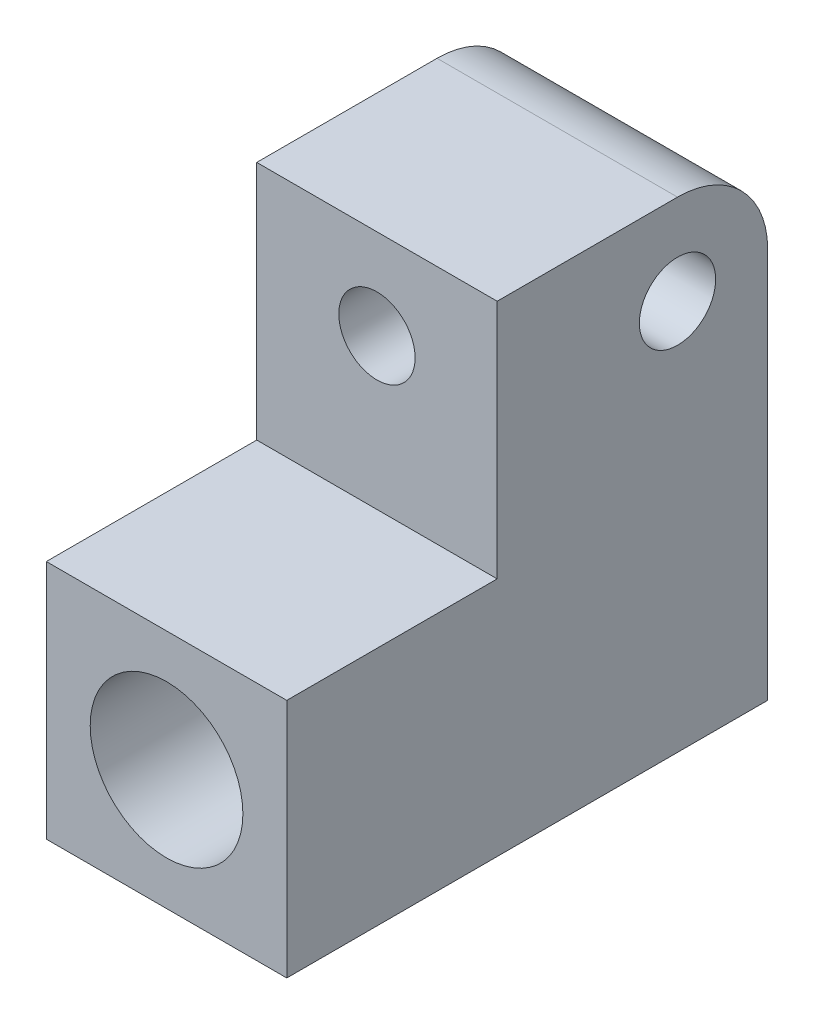
ISO-10303-21;
HEADER;
FILE_DESCRIPTION(('STEP AP214'),'2;1');
FILE_NAME('part.step','',(''),(''),'','','');
FILE_SCHEMA(('AUTOMOTIVE_DESIGN { 1 0 10303 214 1 1 1 1 }'));
ENDSEC;
DATA;
#1=APPLICATION_CONTEXT('core data for automotive mechanical design processes');
#2=APPLICATION_PROTOCOL_DEFINITION('international standard','automotive_design',2000,#1);
#3=PRODUCT_CONTEXT('',#1,'mechanical');
#4=PRODUCT('Part','Part','',(#3));
#5=PRODUCT_RELATED_PRODUCT_CATEGORY('part','',(#4));
#6=PRODUCT_DEFINITION_FORMATION('','',#4);
#7=PRODUCT_DEFINITION_CONTEXT('part definition',#1,'design');
#8=PRODUCT_DEFINITION('design','',#6,#7);
#9=PRODUCT_DEFINITION_SHAPE('','',#8);
#10=(LENGTH_UNIT() NAMED_UNIT(*) SI_UNIT(.MILLI.,.METRE.));
#11=(NAMED_UNIT(*) PLANE_ANGLE_UNIT() SI_UNIT($,.RADIAN.));
#12=(NAMED_UNIT(*) SI_UNIT($,.STERADIAN.) SOLID_ANGLE_UNIT());
#13=UNCERTAINTY_MEASURE_WITH_UNIT(LENGTH_MEASURE(1.E-05),#10,'distance_accuracy_value','');
#14=(GEOMETRIC_REPRESENTATION_CONTEXT(3) GLOBAL_UNCERTAINTY_ASSIGNED_CONTEXT((#13)) GLOBAL_UNIT_ASSIGNED_CONTEXT((#10,
#11,#12)) REPRESENTATION_CONTEXT('',''));
#15=CARTESIAN_POINT('',(0.,0.,0.));
#16=DIRECTION('',(0.,0.,1.));
#17=DIRECTION('',(1.,0.,0.));
#18=AXIS2_PLACEMENT_3D('',#15,#16,#17);
#19=CARTESIAN_POINT('',(-10.,20.,20.));
#20=DIRECTION('',(0.,0.,-1.));
#21=DIRECTION('',(-1.,0.,0.));
#22=AXIS2_PLACEMENT_3D('',#19,#20,#21);
#23=PLANE('',#22);
#24=CARTESIAN_POINT('',(0.,-10.,20.));
#25=DIRECTION('',(0.,0.,1.));
#26=DIRECTION('',(1.,0.,0.));
#27=AXIS2_PLACEMENT_3D('',#24,#25,#26);
#28=CIRCLE('',#27,6.35);
#29=CARTESIAN_POINT('',(6.35,-10.,20.));
#30=VERTEX_POINT('',#29);
#31=EDGE_CURVE('E107',#30,#30,#28,.T.);
#32=ORIENTED_EDGE('',*,*,#31,.F.);
#33=EDGE_LOOP('',(#32));
#34=FACE_BOUND('',#33,.T.);
#35=DIRECTION('',(1.,0.,0.));
#36=VECTOR('',#35,1.);
#37=CARTESIAN_POINT('',(-10.,0.,20.));
#38=LINE('',#37,#36);
#39=CARTESIAN_POINT('',(-10.,0.,20.));
#40=VERTEX_POINT('',#39);
#41=CARTESIAN_POINT('',(10.,0.,20.));
#42=VERTEX_POINT('',#41);
#43=EDGE_CURVE('E112',#40,#42,#38,.T.);
#44=ORIENTED_EDGE('',*,*,#43,.F.);
#45=DIRECTION('',(0.,-1.,0.));
#46=VECTOR('',#45,1.);
#47=CARTESIAN_POINT('',(-10.,20.,20.));
#48=LINE('',#47,#46);
#49=CARTESIAN_POINT('',(-10.,-20.,20.));
#50=VERTEX_POINT('',#49);
#51=EDGE_CURVE('E153',#40,#50,#48,.T.);
#52=ORIENTED_EDGE('',*,*,#51,.T.);
#53=DIRECTION('',(1.,0.,0.));
#54=VECTOR('',#53,1.);
#55=CARTESIAN_POINT('',(-10.,-20.,20.));
#56=LINE('',#55,#54);
#57=CARTESIAN_POINT('',(10.,-20.,20.));
#58=VERTEX_POINT('',#57);
#59=EDGE_CURVE('E140',#50,#58,#56,.T.);
#60=ORIENTED_EDGE('',*,*,#59,.T.);
#61=DIRECTION('',(0.,-1.,0.));
#62=VECTOR('',#61,1.);
#63=CARTESIAN_POINT('',(10.,20.,20.));
#64=LINE('',#63,#62);
#65=EDGE_CURVE('E151',#42,#58,#64,.T.);
#66=ORIENTED_EDGE('',*,*,#65,.F.);
#67=EDGE_LOOP('',(#44,#52,#60,#66));
#68=FACE_BOUND('',#67,.T.);
#69=ADVANCED_FACE('F31',(#34,#68),#23,.F.);
#70=CARTESIAN_POINT('',(-10.,20.,-20.));
#71=DIRECTION('',(1.,0.,0.));
#72=DIRECTION('',(0.,0.,-1.));
#73=AXIS2_PLACEMENT_3D('',#70,#71,#72);
#74=PLANE('',#73);
#75=CARTESIAN_POINT('',(-10.,12.5,-12.5));
#76=DIRECTION('',(-1.,0.,0.));
#77=DIRECTION('',(0.,0.,1.));
#78=AXIS2_PLACEMENT_3D('',#75,#76,#77);
#79=CIRCLE('',#78,3.175);
#80=CARTESIAN_POINT('',(-10.,12.5,-9.325));
#81=VERTEX_POINT('',#80);
#82=EDGE_CURVE('E123',#81,#81,#79,.T.);
#83=ORIENTED_EDGE('',*,*,#82,.F.);
#84=EDGE_LOOP('',(#83));
#85=FACE_BOUND('',#84,.T.);
#86=DIRECTION('',(0.,0.,1.));
#87=VECTOR('',#86,1.);
#88=CARTESIAN_POINT('',(-10.,0.,2.5));
#89=LINE('',#88,#87);
#90=CARTESIAN_POINT('',(-10.,0.,2.5));
#91=VERTEX_POINT('',#90);
#92=EDGE_CURVE('E110',#91,#40,#89,.T.);
#93=ORIENTED_EDGE('',*,*,#92,.F.);
#94=DIRECTION('',(0.,1.,0.));
#95=VECTOR('',#94,1.);
#96=CARTESIAN_POINT('',(-10.,0.,2.5));
#97=LINE('',#96,#95);
#98=CARTESIAN_POINT('',(-10.,20.,2.5));
#99=VERTEX_POINT('',#98);
#100=EDGE_CURVE('E120',#91,#99,#97,.T.);
#101=ORIENTED_EDGE('',*,*,#100,.T.);
#102=DIRECTION('',(0.,0.,1.));
#103=VECTOR('',#102,1.);
#104=CARTESIAN_POINT('',(-10.,20.,-20.));
#105=LINE('',#104,#103);
#106=CARTESIAN_POINT('',(-10.,20.,-12.5));
#107=VERTEX_POINT('',#106);
#108=EDGE_CURVE('E131',#107,#99,#105,.T.);
#109=ORIENTED_EDGE('',*,*,#108,.F.);
#110=CARTESIAN_POINT('',(-10.,12.5,-12.5));
#111=DIRECTION('',(1.,0.,0.));
#112=DIRECTION('',(0.,0.,-1.));
#113=AXIS2_PLACEMENT_3D('',#110,#111,#112);
#114=CIRCLE('',#113,7.5);
#115=CARTESIAN_POINT('',(-10.,12.5,-20.));
#116=VERTEX_POINT('',#115);
#117=EDGE_CURVE('E158',#107,#116,#114,.F.);
#118=ORIENTED_EDGE('',*,*,#117,.T.);
#119=DIRECTION('',(0.,-1.,0.));
#120=VECTOR('',#119,1.);
#121=CARTESIAN_POINT('',(-10.,20.,-20.));
#122=LINE('',#121,#120);
#123=CARTESIAN_POINT('',(-10.,-20.,-20.));
#124=VERTEX_POINT('',#123);
#125=EDGE_CURVE('E137',#116,#124,#122,.T.);
#126=ORIENTED_EDGE('',*,*,#125,.T.);
#127=DIRECTION('',(0.,0.,1.));
#128=VECTOR('',#127,1.);
#129=CARTESIAN_POINT('',(-10.,-20.,-20.));
#130=LINE('',#129,#128);
#131=EDGE_CURVE('E128',#124,#50,#130,.T.);
#132=ORIENTED_EDGE('',*,*,#131,.T.);
#133=ORIENTED_EDGE('',*,*,#51,.F.);
#134=EDGE_LOOP('',(#93,#101,#109,#118,#126,#132,#133));
#135=FACE_BOUND('',#134,.T.);
#136=ADVANCED_FACE('F177',(#85,#135),#74,.F.);
#137=CARTESIAN_POINT('',(10.,20.,-20.));
#138=DIRECTION('',(-1.,0.,0.));
#139=DIRECTION('',(0.,0.,1.));
#140=AXIS2_PLACEMENT_3D('',#137,#138,#139);
#141=PLANE('',#140);
#142=CARTESIAN_POINT('',(10.,12.5,-12.5));
#143=DIRECTION('',(-1.,0.,0.));
#144=DIRECTION('',(0.,0.,1.));
#145=AXIS2_PLACEMENT_3D('',#142,#143,#144);
#146=CIRCLE('',#145,3.175);
#147=CARTESIAN_POINT('',(10.,12.5,-9.325));
#148=VERTEX_POINT('',#147);
#149=EDGE_CURVE('E125',#148,#148,#146,.T.);
#150=ORIENTED_EDGE('',*,*,#149,.T.);
#151=EDGE_LOOP('',(#150));
#152=FACE_BOUND('',#151,.T.);
#153=DIRECTION('',(0.,0.,-1.));
#154=VECTOR('',#153,1.);
#155=CARTESIAN_POINT('',(10.,20.,-20.));
#156=LINE('',#155,#154);
#157=CARTESIAN_POINT('',(10.,20.,2.5));
#158=VERTEX_POINT('',#157);
#159=CARTESIAN_POINT('',(10.,20.,-12.5));
#160=VERTEX_POINT('',#159);
#161=EDGE_CURVE('E134',#158,#160,#156,.T.);
#162=ORIENTED_EDGE('',*,*,#161,.F.);
#163=DIRECTION('',(0.,1.,0.));
#164=VECTOR('',#163,1.);
#165=CARTESIAN_POINT('',(10.,0.,2.5));
#166=LINE('',#165,#164);
#167=CARTESIAN_POINT('',(10.,0.,2.5));
#168=VERTEX_POINT('',#167);
#169=EDGE_CURVE('E53',#168,#158,#166,.T.);
#170=ORIENTED_EDGE('',*,*,#169,.F.);
#171=DIRECTION('',(0.,0.,-1.));
#172=VECTOR('',#171,1.);
#173=CARTESIAN_POINT('',(10.,0.,2.5));
#174=LINE('',#173,#172);
#175=EDGE_CURVE('E114',#42,#168,#174,.T.);
#176=ORIENTED_EDGE('',*,*,#175,.F.);
#177=ORIENTED_EDGE('',*,*,#65,.T.);
#178=DIRECTION('',(0.,0.,-1.));
#179=VECTOR('',#178,1.);
#180=CARTESIAN_POINT('',(10.,-20.,-20.));
#181=LINE('',#180,#179);
#182=CARTESIAN_POINT('',(10.,-20.,-20.));
#183=VERTEX_POINT('',#182);
#184=EDGE_CURVE('E143',#58,#183,#181,.T.);
#185=ORIENTED_EDGE('',*,*,#184,.T.);
#186=DIRECTION('',(0.,-1.,0.));
#187=VECTOR('',#186,1.);
#188=CARTESIAN_POINT('',(10.,20.,-20.));
#189=LINE('',#188,#187);
#190=CARTESIAN_POINT('',(10.,12.5,-20.));
#191=VERTEX_POINT('',#190);
#192=EDGE_CURVE('E149',#191,#183,#189,.T.);
#193=ORIENTED_EDGE('',*,*,#192,.F.);
#194=CARTESIAN_POINT('',(10.,12.5,-12.5));
#195=DIRECTION('',(-1.,0.,0.));
#196=DIRECTION('',(0.,0.,1.));
#197=AXIS2_PLACEMENT_3D('',#194,#195,#196);
#198=CIRCLE('',#197,7.5);
#199=EDGE_CURVE('E11',#191,#160,#198,.F.);
#200=ORIENTED_EDGE('',*,*,#199,.T.);
#201=EDGE_LOOP('',(#162,#170,#176,#177,#185,#193,#200));
#202=FACE_BOUND('',#201,.T.);
#203=ADVANCED_FACE('F168',(#152,#202),#141,.F.);
#204=CARTESIAN_POINT('',(-10.,20.,-20.));
#205=DIRECTION('',(0.,0.,1.));
#206=DIRECTION('',(1.,0.,0.));
#207=AXIS2_PLACEMENT_3D('',#204,#205,#206);
#208=PLANE('',#207);
#209=CARTESIAN_POINT('',(0.,-10.,-20.));
#210=DIRECTION('',(0.,0.,1.));
#211=DIRECTION('',(1.,0.,0.));
#212=AXIS2_PLACEMENT_3D('',#209,#210,#211);
#213=CIRCLE('',#212,6.35);
#214=CARTESIAN_POINT('',(6.35,-10.,-20.));
#215=VERTEX_POINT('',#214);
#216=EDGE_CURVE('E97',#215,#215,#213,.T.);
#217=ORIENTED_EDGE('',*,*,#216,.T.);
#218=EDGE_LOOP('',(#217));
#219=FACE_BOUND('',#218,.T.);
#220=ORIENTED_EDGE('',*,*,#125,.F.);
#221=DIRECTION('',(-1.,0.,0.));
#222=VECTOR('',#221,1.);
#223=CARTESIAN_POINT('',(10.,12.5,-20.));
#224=LINE('',#223,#222);
#225=EDGE_CURVE('E39',#116,#191,#224,.F.);
#226=ORIENTED_EDGE('',*,*,#225,.T.);
#227=ORIENTED_EDGE('',*,*,#192,.T.);
#228=DIRECTION('',(-1.,0.,0.));
#229=VECTOR('',#228,1.);
#230=CARTESIAN_POINT('',(-10.,-20.,-20.));
#231=LINE('',#230,#229);
#232=EDGE_CURVE('E135',#183,#124,#231,.T.);
#233=ORIENTED_EDGE('',*,*,#232,.T.);
#234=EDGE_LOOP('',(#220,#226,#227,#233));
#235=FACE_BOUND('',#234,.T.);
#236=ADVANCED_FACE('F163',(#219,#235),#208,.F.);
#237=CARTESIAN_POINT('',(-10.,20.,20.));
#238=DIRECTION('',(0.,1.,0.));
#239=DIRECTION('',(0.,0.,1.));
#240=AXIS2_PLACEMENT_3D('',#237,#238,#239);
#241=PLANE('',#240);
#242=DIRECTION('',(-1.,0.,0.));
#243=VECTOR('',#242,1.);
#244=CARTESIAN_POINT('',(-10.,20.,2.5));
#245=LINE('',#244,#243);
#246=EDGE_CURVE('E104',#158,#99,#245,.T.);
#247=ORIENTED_EDGE('',*,*,#246,.F.);
#248=ORIENTED_EDGE('',*,*,#161,.T.);
#249=DIRECTION('',(-1.,0.,0.));
#250=VECTOR('',#249,1.);
#251=CARTESIAN_POINT('',(-10.,20.,-12.5));
#252=LINE('',#251,#250);
#253=EDGE_CURVE('E155',#160,#107,#252,.T.);
#254=ORIENTED_EDGE('',*,*,#253,.T.);
#255=ORIENTED_EDGE('',*,*,#108,.T.);
#256=EDGE_LOOP('',(#247,#248,#254,#255));
#257=FACE_BOUND('',#256,.T.);
#258=ADVANCED_FACE('F174',(#257),#241,.T.);
#259=CARTESIAN_POINT('',(-10.,-20.,20.));
#260=DIRECTION('',(0.,1.,0.));
#261=DIRECTION('',(0.,0.,1.));
#262=AXIS2_PLACEMENT_3D('',#259,#260,#261);
#263=PLANE('',#262);
#264=ORIENTED_EDGE('',*,*,#131,.F.);
#265=ORIENTED_EDGE('',*,*,#232,.F.);
#266=ORIENTED_EDGE('',*,*,#184,.F.);
#267=ORIENTED_EDGE('',*,*,#59,.F.);
#268=EDGE_LOOP('',(#264,#265,#266,#267));
#269=FACE_BOUND('',#268,.T.);
#270=ADVANCED_FACE('F189',(#269),#263,.F.);
#271=CARTESIAN_POINT('',(-10.,12.5,-12.5));
#272=DIRECTION('',(1.,0.,0.));
#273=DIRECTION('',(0.,0.,-1.));
#274=AXIS2_PLACEMENT_3D('',#271,#272,#273);
#275=CYLINDRICAL_SURFACE('',#274,7.5);
#276=ORIENTED_EDGE('',*,*,#199,.F.);
#277=ORIENTED_EDGE('',*,*,#225,.F.);
#278=ORIENTED_EDGE('',*,*,#117,.F.);
#279=ORIENTED_EDGE('',*,*,#253,.F.);
#280=EDGE_LOOP('',(#276,#277,#278,#279));
#281=FACE_BOUND('',#280,.T.);
#282=ADVANCED_FACE('F33',(#281),#275,.T.);
#283=CARTESIAN_POINT('',(10.,12.5,-12.5));
#284=DIRECTION('',(-1.,0.,0.));
#285=DIRECTION('',(0.,0.,1.));
#286=AXIS2_PLACEMENT_3D('',#283,#284,#285);
#287=CYLINDRICAL_SURFACE('',#286,3.175);
#288=CARTESIAN_POINT('',(0.,12.5,-12.5));
#289=DIRECTION('',(0.707106781186548,0.,0.707106781186547));
#290=DIRECTION('',(-0.707106781186547,0.,0.707106781186547));
#291=AXIS2_PLACEMENT_3D('',#288,#289,#290);
#292=ELLIPSE('',#291,4.49012806053458,3.175);
#293=CARTESIAN_POINT('',(0.,9.325,-12.5));
#294=VERTEX_POINT('',#293);
#295=CARTESIAN_POINT('',(0.,15.675,-12.5));
#296=VERTEX_POINT('',#295);
#297=EDGE_CURVE('E94',#294,#296,#292,.F.);
#298=ORIENTED_EDGE('',*,*,#297,.F.);
#299=CARTESIAN_POINT('',(0.,12.5,-12.5));
#300=DIRECTION('',(-0.707106781186547,0.,0.707106781186547));
#301=DIRECTION('',(0.707106781186548,0.,0.707106781186547));
#302=AXIS2_PLACEMENT_3D('',#299,#300,#301);
#303=ELLIPSE('',#302,4.49012806053458,3.175);
#304=EDGE_CURVE('E45',#296,#294,#303,.F.);
#305=ORIENTED_EDGE('',*,*,#304,.F.);
#306=EDGE_LOOP('',(#298,#305));
#307=FACE_BOUND('',#306,.T.);
#308=ORIENTED_EDGE('',*,*,#149,.F.);
#309=EDGE_LOOP('',(#308));
#310=FACE_BOUND('',#309,.T.);
#311=ORIENTED_EDGE('',*,*,#82,.T.);
#312=EDGE_LOOP('',(#311));
#313=FACE_BOUND('',#312,.T.);
#314=ADVANCED_FACE('F99',(#307,#310,#313),#287,.F.);
#315=CARTESIAN_POINT('',(-10.,0.,2.5));
#316=DIRECTION('',(0.,0.,-1.));
#317=DIRECTION('',(-1.,0.,0.));
#318=AXIS2_PLACEMENT_3D('',#315,#316,#317);
#319=PLANE('',#318);
#320=CARTESIAN_POINT('',(0.,12.5,2.5));
#321=DIRECTION('',(0.,0.,1.));
#322=DIRECTION('',(1.,0.,0.));
#323=AXIS2_PLACEMENT_3D('',#320,#321,#322);
#324=CIRCLE('',#323,3.175);
#325=CARTESIAN_POINT('',(3.175,12.5,2.5));
#326=VERTEX_POINT('',#325);
#327=EDGE_CURVE('E101',#326,#326,#324,.T.);
#328=ORIENTED_EDGE('',*,*,#327,.F.);
#329=EDGE_LOOP('',(#328));
#330=FACE_BOUND('',#329,.T.);
#331=ORIENTED_EDGE('',*,*,#246,.T.);
#332=ORIENTED_EDGE('',*,*,#100,.F.);
#333=DIRECTION('',(-1.,0.,0.));
#334=VECTOR('',#333,1.);
#335=CARTESIAN_POINT('',(-10.,0.,2.5));
#336=LINE('',#335,#334);
#337=EDGE_CURVE('E116',#168,#91,#336,.T.);
#338=ORIENTED_EDGE('',*,*,#337,.F.);
#339=ORIENTED_EDGE('',*,*,#169,.T.);
#340=EDGE_LOOP('',(#331,#332,#338,#339));
#341=FACE_BOUND('',#340,.T.);
#342=ADVANCED_FACE('F179',(#330,#341),#319,.F.);
#343=CARTESIAN_POINT('',(-10.,0.,20.));
#344=DIRECTION('',(0.,1.,0.));
#345=DIRECTION('',(0.,0.,1.));
#346=AXIS2_PLACEMENT_3D('',#343,#344,#345);
#347=PLANE('',#346);
#348=ORIENTED_EDGE('',*,*,#92,.T.);
#349=ORIENTED_EDGE('',*,*,#43,.T.);
#350=ORIENTED_EDGE('',*,*,#175,.T.);
#351=ORIENTED_EDGE('',*,*,#337,.T.);
#352=EDGE_LOOP('',(#348,#349,#350,#351));
#353=FACE_BOUND('',#352,.T.);
#354=ADVANCED_FACE('F181',(#353),#347,.T.);
#355=CARTESIAN_POINT('',(0.,12.5,-20.001));
#356=DIRECTION('',(0.,0.,1.));
#357=DIRECTION('',(1.,0.,0.));
#358=AXIS2_PLACEMENT_3D('',#355,#356,#357);
#359=CYLINDRICAL_SURFACE('',#358,3.175);
#360=ORIENTED_EDGE('',*,*,#327,.T.);
#361=EDGE_LOOP('',(#360));
#362=FACE_BOUND('',#361,.T.);
#363=ORIENTED_EDGE('',*,*,#304,.T.);
#364=ORIENTED_EDGE('',*,*,#297,.T.);
#365=EDGE_LOOP('',(#363,#364));
#366=FACE_BOUND('',#365,.T.);
#367=ADVANCED_FACE('F95',(#362,#366),#359,.F.);
#368=CARTESIAN_POINT('',(0.,-10.,-20.));
#369=DIRECTION('',(0.,0.,1.));
#370=DIRECTION('',(1.,0.,0.));
#371=AXIS2_PLACEMENT_3D('',#368,#369,#370);
#372=CYLINDRICAL_SURFACE('',#371,6.35);
#373=ORIENTED_EDGE('',*,*,#216,.F.);
#374=EDGE_LOOP('',(#373));
#375=FACE_BOUND('',#374,.T.);
#376=ORIENTED_EDGE('',*,*,#31,.T.);
#377=EDGE_LOOP('',(#376));
#378=FACE_BOUND('',#377,.T.);
#379=ADVANCED_FACE('F218',(#375,#378),#372,.F.);
#380=CLOSED_SHELL('',(#69,#136,#203,#236,#258,#270,#282,#314,#342,#354,#367,#379));
#381=MANIFOLD_SOLID_BREP('B2',#380);
#382=ADVANCED_BREP_SHAPE_REPRESENTATION('',(#18,#381),#14);
#383=SHAPE_DEFINITION_REPRESENTATION(#9,#382);
ENDSEC;
END-ISO-10303-21;
